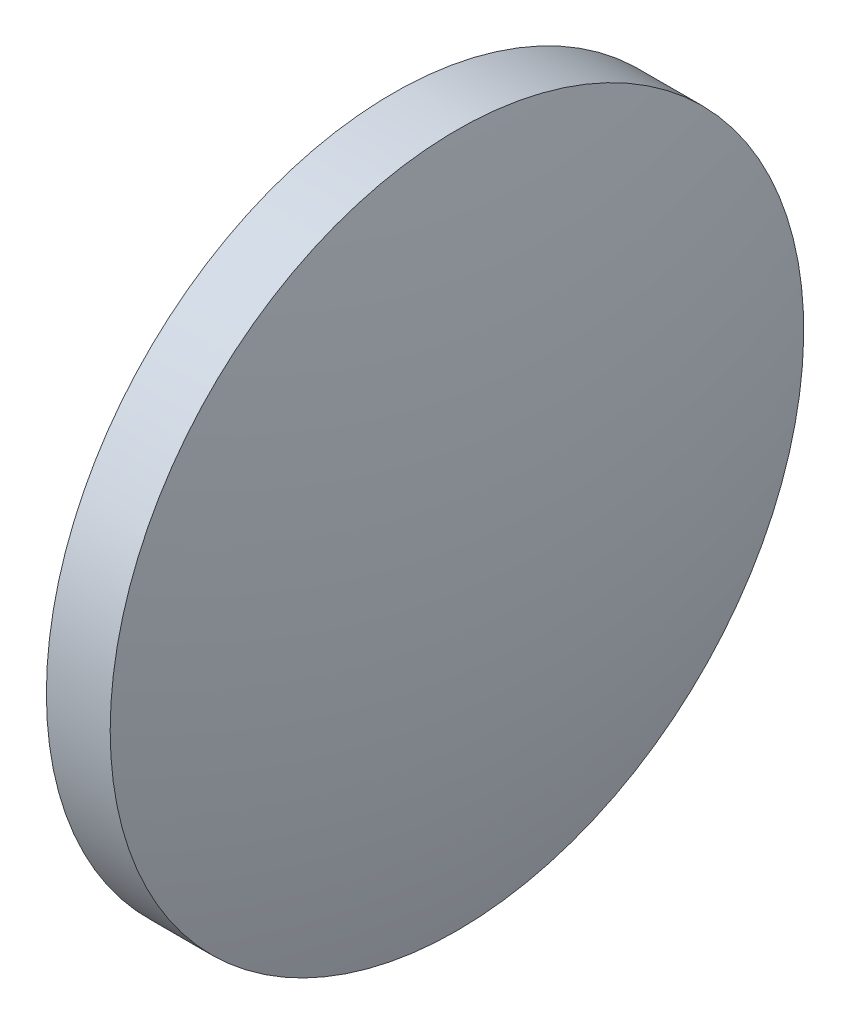
ISO-10303-21;
HEADER;
FILE_DESCRIPTION(('STEP AP214'),'2;1');
FILE_NAME('part.step','',(''),(''),'','','');
FILE_SCHEMA(('AUTOMOTIVE_DESIGN { 1 0 10303 214 1 1 1 1 }'));
ENDSEC;
DATA;
#1=APPLICATION_CONTEXT('core data for automotive mechanical design processes');
#2=APPLICATION_PROTOCOL_DEFINITION('international standard','automotive_design',2000,#1);
#3=PRODUCT_CONTEXT('',#1,'mechanical');
#4=PRODUCT('Part','Part','',(#3));
#5=PRODUCT_RELATED_PRODUCT_CATEGORY('part','',(#4));
#6=PRODUCT_DEFINITION_FORMATION('','',#4);
#7=PRODUCT_DEFINITION_CONTEXT('part definition',#1,'design');
#8=PRODUCT_DEFINITION('design','',#6,#7);
#9=PRODUCT_DEFINITION_SHAPE('','',#8);
#10=(LENGTH_UNIT() NAMED_UNIT(*) SI_UNIT(.MILLI.,.METRE.));
#11=(NAMED_UNIT(*) PLANE_ANGLE_UNIT() SI_UNIT($,.RADIAN.));
#12=(NAMED_UNIT(*) SI_UNIT($,.STERADIAN.) SOLID_ANGLE_UNIT());
#13=UNCERTAINTY_MEASURE_WITH_UNIT(LENGTH_MEASURE(1.E-05),#10,'distance_accuracy_value','');
#14=(GEOMETRIC_REPRESENTATION_CONTEXT(3) GLOBAL_UNCERTAINTY_ASSIGNED_CONTEXT((#13)) GLOBAL_UNIT_ASSIGNED_CONTEXT((#10,
#11,#12)) REPRESENTATION_CONTEXT('',''));
#15=CARTESIAN_POINT('',(0.,0.,0.));
#16=DIRECTION('',(0.,0.,1.));
#17=DIRECTION('',(1.,0.,0.));
#18=AXIS2_PLACEMENT_3D('',#15,#16,#17);
#19=CARTESIAN_POINT('',(550.257504625606,147.276559921942,0.));
#20=DIRECTION('',(-1.,0.,0.));
#21=DIRECTION('',(0.,-1.,0.));
#22=AXIS2_PLACEMENT_3D('',#19,#20,#21);
#23=SPHERICAL_SURFACE('',#22,31.0306521739133);
#24=CARTESIAN_POINT('',(580.368156799519,147.276559921941,0.));
#25=DIRECTION('',(-1.,0.,0.));
#26=DIRECTION('',(0.,0.,1.));
#27=AXIS2_PLACEMENT_3D('',#24,#25,#26);
#28=CIRCLE('',#27,7.50000000000001);
#29=CARTESIAN_POINT('',(580.368156799519,147.276559921941,7.50000000000001));
#30=VERTEX_POINT('',#29);
#31=EDGE_CURVE('E10',#30,#30,#28,.T.);
#32=ORIENTED_EDGE('',*,*,#31,.F.);
#33=EDGE_LOOP('',(#32));
#34=FACE_BOUND('',#33,.T.);
#35=ADVANCED_FACE('F35',(#34),#23,.T.);
#36=CARTESIAN_POINT('',(576.661469741995,147.276559921941,0.));
#37=DIRECTION('',(-1.,0.,0.));
#38=DIRECTION('',(0.,0.,1.));
#39=AXIS2_PLACEMENT_3D('',#36,#37,#38);
#40=CYLINDRICAL_SURFACE('',#39,7.50000000000001);
#41=CARTESIAN_POINT('',(578.988156799519,147.276559921941,0.));
#42=DIRECTION('',(-1.,0.,0.));
#43=DIRECTION('',(0.,0.,1.));
#44=AXIS2_PLACEMENT_3D('',#41,#42,#43);
#45=CIRCLE('',#44,7.50000000000001);
#46=CARTESIAN_POINT('',(578.988156799519,147.276559921941,7.50000000000001));
#47=VERTEX_POINT('',#46);
#48=EDGE_CURVE('E41',#47,#47,#45,.T.);
#49=ORIENTED_EDGE('',*,*,#48,.F.);
#50=EDGE_LOOP('',(#49));
#51=FACE_BOUND('',#50,.T.);
#52=ORIENTED_EDGE('',*,*,#31,.T.);
#53=EDGE_LOOP('',(#52));
#54=FACE_BOUND('',#53,.T.);
#55=ADVANCED_FACE('F49',(#51,#54),#40,.T.);
#56=CARTESIAN_POINT('',(578.988156799519,147.276559921941,0.));
#57=DIRECTION('',(1.,0.,0.));
#58=DIRECTION('',(0.,0.,-1.));
#59=AXIS2_PLACEMENT_3D('',#56,#57,#58);
#60=PLANE('',#59);
#61=ORIENTED_EDGE('',*,*,#48,.T.);
#62=EDGE_LOOP('',(#61));
#63=FACE_BOUND('',#62,.T.);
#64=ADVANCED_FACE('F47',(#63),#60,.F.);
#65=CLOSED_SHELL('',(#35,#55,#64));
#66=MANIFOLD_SOLID_BREP('B2',#65);
#67=ADVANCED_BREP_SHAPE_REPRESENTATION('',(#18,#66),#14);
#68=SHAPE_DEFINITION_REPRESENTATION(#9,#67);
ENDSEC;
END-ISO-10303-21;
